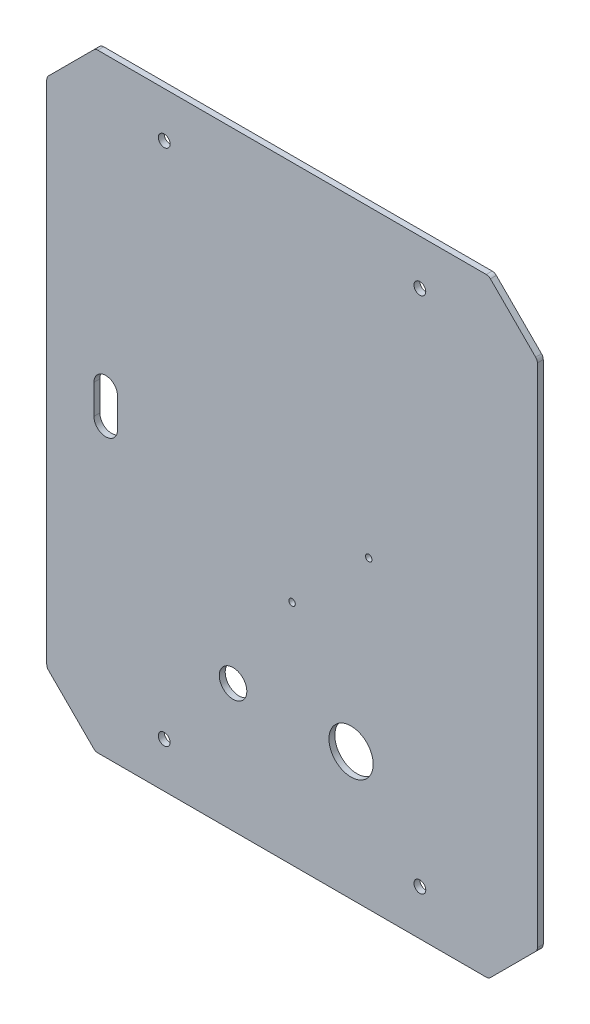
ISO-10303-21;
HEADER;
FILE_DESCRIPTION(('STEP AP214'),'2;1');
FILE_NAME('part.step','',(''),(''),'','','');
FILE_SCHEMA(('AUTOMOTIVE_DESIGN { 1 0 10303 214 1 1 1 1 }'));
ENDSEC;
DATA;
#1=APPLICATION_CONTEXT('core data for automotive mechanical design processes');
#2=APPLICATION_PROTOCOL_DEFINITION('international standard','automotive_design',2000,#1);
#3=PRODUCT_CONTEXT('',#1,'mechanical');
#4=PRODUCT('Part','Part','',(#3));
#5=PRODUCT_RELATED_PRODUCT_CATEGORY('part','',(#4));
#6=PRODUCT_DEFINITION_FORMATION('','',#4);
#7=PRODUCT_DEFINITION_CONTEXT('part definition',#1,'design');
#8=PRODUCT_DEFINITION('design','',#6,#7);
#9=PRODUCT_DEFINITION_SHAPE('','',#8);
#10=(LENGTH_UNIT() NAMED_UNIT(*) SI_UNIT(.MILLI.,.METRE.));
#11=(NAMED_UNIT(*) PLANE_ANGLE_UNIT() SI_UNIT($,.RADIAN.));
#12=(NAMED_UNIT(*) SI_UNIT($,.STERADIAN.) SOLID_ANGLE_UNIT());
#13=UNCERTAINTY_MEASURE_WITH_UNIT(LENGTH_MEASURE(1.E-05),#10,'distance_accuracy_value','');
#14=(GEOMETRIC_REPRESENTATION_CONTEXT(3) GLOBAL_UNCERTAINTY_ASSIGNED_CONTEXT((#13)) GLOBAL_UNIT_ASSIGNED_CONTEXT((#10,
#11,#12)) REPRESENTATION_CONTEXT('',''));
#15=CARTESIAN_POINT('',(0.,0.,0.));
#16=DIRECTION('',(0.,0.,1.));
#17=DIRECTION('',(1.,0.,0.));
#18=AXIS2_PLACEMENT_3D('',#15,#16,#17);
#19=CARTESIAN_POINT('',(24.7487373415291,24.7487373415292,3.));
#20=DIRECTION('',(-0.707106781186548,0.707106781186547,0.));
#21=DIRECTION('',(-0.707106781186547,-0.707106781186548,0.));
#22=AXIS2_PLACEMENT_3D('',#19,#20,#21);
#23=PLANE('',#22);
#24=DIRECTION('',(0.707106781186547,0.707106781186548,0.));
#25=VECTOR('',#24,1.);
#26=CARTESIAN_POINT('',(24.7487373415291,24.7487373415292,0.));
#27=LINE('',#26,#25);
#28=CARTESIAN_POINT('',(0.87867965644035,0.87867965644035,0.));
#29=VERTEX_POINT('',#28);
#30=CARTESIAN_POINT('',(23.8700576850888,23.8700576850888,0.));
#31=VERTEX_POINT('',#30);
#32=EDGE_CURVE('E272',#29,#31,#27,.T.);
#33=ORIENTED_EDGE('',*,*,#32,.T.);
#34=DIRECTION('',(0.,0.,-1.));
#35=VECTOR('',#34,1.);
#36=CARTESIAN_POINT('',(23.8700576850888,23.8700576850888,3.));
#37=LINE('',#36,#35);
#38=CARTESIAN_POINT('',(23.8700576850888,23.8700576850888,3.));
#39=VERTEX_POINT('',#38);
#40=EDGE_CURVE('E12',#31,#39,#37,.F.);
#41=ORIENTED_EDGE('',*,*,#40,.T.);
#42=DIRECTION('',(0.707106781186547,0.707106781186548,0.));
#43=VECTOR('',#42,1.);
#44=CARTESIAN_POINT('',(24.7487373415291,24.7487373415292,3.));
#45=LINE('',#44,#43);
#46=CARTESIAN_POINT('',(0.87867965644035,0.87867965644035,3.));
#47=VERTEX_POINT('',#46);
#48=EDGE_CURVE('E278',#47,#39,#45,.T.);
#49=ORIENTED_EDGE('',*,*,#48,.F.);
#50=DIRECTION('',(0.,0.,-1.));
#51=VECTOR('',#50,1.);
#52=CARTESIAN_POINT('',(0.87867965644035,0.878679656440354,3.));
#53=LINE('',#52,#51);
#54=EDGE_CURVE('E54',#47,#29,#53,.T.);
#55=ORIENTED_EDGE('',*,*,#54,.T.);
#56=EDGE_LOOP('',(#33,#41,#49,#55));
#57=FACE_BOUND('',#56,.T.);
#58=ADVANCED_FACE('F46',(#57),#23,.F.);
#59=CARTESIAN_POINT('',(24.7487373415291,284.748737341529,3.));
#60=DIRECTION('',(-1.,0.,0.));
#61=DIRECTION('',(0.,-1.,0.));
#62=AXIS2_PLACEMENT_3D('',#59,#60,#61);
#63=PLANE('',#62);
#64=DIRECTION('',(0.,1.,0.));
#65=VECTOR('',#64,1.);
#66=CARTESIAN_POINT('',(24.7487373415291,284.748737341529,0.));
#67=LINE('',#66,#65);
#68=CARTESIAN_POINT('',(24.7487373415291,25.9913780286485,0.));
#69=VERTEX_POINT('',#68);
#70=CARTESIAN_POINT('',(24.7487373415291,283.50609665441,0.));
#71=VERTEX_POINT('',#70);
#72=EDGE_CURVE('E316',#69,#71,#67,.T.);
#73=ORIENTED_EDGE('',*,*,#72,.T.);
#74=DIRECTION('',(0.,0.,-1.));
#75=VECTOR('',#74,1.);
#76=CARTESIAN_POINT('',(24.7487373415291,283.50609665441,3.));
#77=LINE('',#76,#75);
#78=CARTESIAN_POINT('',(24.7487373415291,283.50609665441,3.));
#79=VERTEX_POINT('',#78);
#80=EDGE_CURVE('E400',#71,#79,#77,.F.);
#81=ORIENTED_EDGE('',*,*,#80,.T.);
#82=DIRECTION('',(0.,1.,0.));
#83=VECTOR('',#82,1.);
#84=CARTESIAN_POINT('',(24.7487373415291,284.748737341529,3.));
#85=LINE('',#84,#83);
#86=CARTESIAN_POINT('',(24.7487373415291,25.9913780286485,3.));
#87=VERTEX_POINT('',#86);
#88=EDGE_CURVE('E423',#87,#79,#85,.T.);
#89=ORIENTED_EDGE('',*,*,#88,.F.);
#90=DIRECTION('',(0.,0.,-1.));
#91=VECTOR('',#90,1.);
#92=CARTESIAN_POINT('',(24.7487373415291,25.9913780286485,3.));
#93=LINE('',#92,#91);
#94=EDGE_CURVE('E397',#87,#69,#93,.T.);
#95=ORIENTED_EDGE('',*,*,#94,.T.);
#96=EDGE_LOOP('',(#73,#81,#89,#95));
#97=FACE_BOUND('',#96,.T.);
#98=ADVANCED_FACE('F420',(#97),#63,.F.);
#99=CARTESIAN_POINT('',(0.,309.497474683058,3.));
#100=DIRECTION('',(-0.707106781186547,-0.707106781186548,0.));
#101=DIRECTION('',(0.707106781186548,-0.707106781186547,0.));
#102=AXIS2_PLACEMENT_3D('',#99,#100,#101);
#103=PLANE('',#102);
#104=DIRECTION('',(-0.707106781186548,0.707106781186547,0.));
#105=VECTOR('',#104,1.);
#106=CARTESIAN_POINT('',(0.,309.497474683058,0.));
#107=LINE('',#106,#105);
#108=CARTESIAN_POINT('',(23.8700576850888,285.62741699797,0.));
#109=VERTEX_POINT('',#108);
#110=CARTESIAN_POINT('',(0.878679656440274,308.618795026618,0.));
#111=VERTEX_POINT('',#110);
#112=EDGE_CURVE('E321',#109,#111,#107,.T.);
#113=ORIENTED_EDGE('',*,*,#112,.T.);
#114=DIRECTION('',(0.,0.,-1.));
#115=VECTOR('',#114,1.);
#116=CARTESIAN_POINT('',(0.878679656440274,308.618795026618,3.));
#117=LINE('',#116,#115);
#118=CARTESIAN_POINT('',(0.878679656440274,308.618795026618,3.));
#119=VERTEX_POINT('',#118);
#120=EDGE_CURVE('E395',#111,#119,#117,.F.);
#121=ORIENTED_EDGE('',*,*,#120,.T.);
#122=DIRECTION('',(-0.707106781186548,0.707106781186547,0.));
#123=VECTOR('',#122,1.);
#124=CARTESIAN_POINT('',(0.,309.497474683058,3.));
#125=LINE('',#124,#123);
#126=CARTESIAN_POINT('',(23.8700576850888,285.62741699797,3.));
#127=VERTEX_POINT('',#126);
#128=EDGE_CURVE('E426',#127,#119,#125,.T.);
#129=ORIENTED_EDGE('',*,*,#128,.F.);
#130=DIRECTION('',(0.,0.,-1.));
#131=VECTOR('',#130,1.);
#132=CARTESIAN_POINT('',(23.8700576850888,285.62741699797,3.));
#133=LINE('',#132,#131);
#134=EDGE_CURVE('E392',#127,#109,#133,.T.);
#135=ORIENTED_EDGE('',*,*,#134,.T.);
#136=EDGE_LOOP('',(#113,#121,#129,#135));
#137=FACE_BOUND('',#136,.T.);
#138=ADVANCED_FACE('F474',(#137),#103,.F.);
#139=CARTESIAN_POINT('',(-200.,309.497474683058,3.));
#140=DIRECTION('',(0.,-1.,0.));
#141=DIRECTION('',(0.,0.,-1.));
#142=AXIS2_PLACEMENT_3D('',#139,#140,#141);
#143=PLANE('',#142);
#144=DIRECTION('',(-1.,0.,0.));
#145=VECTOR('',#144,1.);
#146=CARTESIAN_POINT('',(-200.,309.497474683058,0.));
#147=LINE('',#146,#145);
#148=CARTESIAN_POINT('',(-1.24264068711938,309.497474683058,0.));
#149=VERTEX_POINT('',#148);
#150=CARTESIAN_POINT('',(-198.757359312881,309.497474683058,0.));
#151=VERTEX_POINT('',#150);
#152=EDGE_CURVE('E325',#149,#151,#147,.T.);
#153=ORIENTED_EDGE('',*,*,#152,.T.);
#154=DIRECTION('',(0.,0.,-1.));
#155=VECTOR('',#154,1.);
#156=CARTESIAN_POINT('',(-198.757359312881,309.497474683058,3.));
#157=LINE('',#156,#155);
#158=CARTESIAN_POINT('',(-198.757359312881,309.497474683058,3.));
#159=VERTEX_POINT('',#158);
#160=EDGE_CURVE('E390',#151,#159,#157,.F.);
#161=ORIENTED_EDGE('',*,*,#160,.T.);
#162=DIRECTION('',(-1.,0.,0.));
#163=VECTOR('',#162,1.);
#164=CARTESIAN_POINT('',(-200.,309.497474683058,3.));
#165=LINE('',#164,#163);
#166=CARTESIAN_POINT('',(-1.24264068711938,309.497474683058,3.));
#167=VERTEX_POINT('',#166);
#168=EDGE_CURVE('E428',#167,#159,#165,.T.);
#169=ORIENTED_EDGE('',*,*,#168,.F.);
#170=DIRECTION('',(0.,0.,-1.));
#171=VECTOR('',#170,1.);
#172=CARTESIAN_POINT('',(-1.24264068711938,309.497474683058,3.));
#173=LINE('',#172,#171);
#174=EDGE_CURVE('E387',#167,#149,#173,.T.);
#175=ORIENTED_EDGE('',*,*,#174,.T.);
#176=EDGE_LOOP('',(#153,#161,#169,#175));
#177=FACE_BOUND('',#176,.T.);
#178=ADVANCED_FACE('F479',(#177),#143,.F.);
#179=CARTESIAN_POINT('',(-224.748737341529,284.748737341529,3.));
#180=DIRECTION('',(0.707106781186549,-0.707106781186546,0.));
#181=DIRECTION('',(0.707106781186546,0.707106781186549,0.));
#182=AXIS2_PLACEMENT_3D('',#179,#180,#181);
#183=PLANE('',#182);
#184=DIRECTION('',(-0.707106781186546,-0.707106781186549,0.));
#185=VECTOR('',#184,1.);
#186=CARTESIAN_POINT('',(-224.748737341529,284.748737341529,0.));
#187=LINE('',#186,#185);
#188=CARTESIAN_POINT('',(-200.87867965644,308.618795026618,0.));
#189=VERTEX_POINT('',#188);
#190=CARTESIAN_POINT('',(-223.870057685089,285.62741699797,0.));
#191=VERTEX_POINT('',#190);
#192=EDGE_CURVE('E344',#189,#191,#187,.T.);
#193=ORIENTED_EDGE('',*,*,#192,.T.);
#194=DIRECTION('',(0.,0.,-1.));
#195=VECTOR('',#194,1.);
#196=CARTESIAN_POINT('',(-223.870057685089,285.62741699797,3.));
#197=LINE('',#196,#195);
#198=CARTESIAN_POINT('',(-223.870057685089,285.62741699797,3.));
#199=VERTEX_POINT('',#198);
#200=EDGE_CURVE('E385',#191,#199,#197,.F.);
#201=ORIENTED_EDGE('',*,*,#200,.T.);
#202=DIRECTION('',(-0.707106781186546,-0.707106781186549,0.));
#203=VECTOR('',#202,1.);
#204=CARTESIAN_POINT('',(-224.748737341529,284.748737341529,3.));
#205=LINE('',#204,#203);
#206=CARTESIAN_POINT('',(-200.87867965644,308.618795026618,3.));
#207=VERTEX_POINT('',#206);
#208=EDGE_CURVE('E433',#207,#199,#205,.T.);
#209=ORIENTED_EDGE('',*,*,#208,.F.);
#210=DIRECTION('',(0.,0.,-1.));
#211=VECTOR('',#210,1.);
#212=CARTESIAN_POINT('',(-200.87867965644,308.618795026618,3.));
#213=LINE('',#212,#211);
#214=EDGE_CURVE('E382',#207,#189,#213,.T.);
#215=ORIENTED_EDGE('',*,*,#214,.T.);
#216=EDGE_LOOP('',(#193,#201,#209,#215));
#217=FACE_BOUND('',#216,.T.);
#218=ADVANCED_FACE('F483',(#217),#183,.F.);
#219=CARTESIAN_POINT('',(-224.748737341529,24.7487373415292,3.));
#220=DIRECTION('',(1.,0.,0.));
#221=DIRECTION('',(0.,1.,0.));
#222=AXIS2_PLACEMENT_3D('',#219,#220,#221);
#223=PLANE('',#222);
#224=DIRECTION('',(0.,-1.,0.));
#225=VECTOR('',#224,1.);
#226=CARTESIAN_POINT('',(-224.748737341529,24.7487373415292,0.));
#227=LINE('',#226,#225);
#228=CARTESIAN_POINT('',(-224.748737341529,283.50609665441,0.));
#229=VERTEX_POINT('',#228);
#230=CARTESIAN_POINT('',(-224.748737341529,25.9913780286484,0.));
#231=VERTEX_POINT('',#230);
#232=EDGE_CURVE('E347',#229,#231,#227,.T.);
#233=ORIENTED_EDGE('',*,*,#232,.T.);
#234=DIRECTION('',(0.,0.,-1.));
#235=VECTOR('',#234,1.);
#236=CARTESIAN_POINT('',(-224.748737341529,25.9913780286484,3.));
#237=LINE('',#236,#235);
#238=CARTESIAN_POINT('',(-224.748737341529,25.9913780286484,3.));
#239=VERTEX_POINT('',#238);
#240=EDGE_CURVE('E380',#231,#239,#237,.F.);
#241=ORIENTED_EDGE('',*,*,#240,.T.);
#242=DIRECTION('',(0.,-1.,0.));
#243=VECTOR('',#242,1.);
#244=CARTESIAN_POINT('',(-224.748737341529,24.7487373415292,3.));
#245=LINE('',#244,#243);
#246=CARTESIAN_POINT('',(-224.748737341529,283.50609665441,3.));
#247=VERTEX_POINT('',#246);
#248=EDGE_CURVE('E436',#247,#239,#245,.T.);
#249=ORIENTED_EDGE('',*,*,#248,.F.);
#250=DIRECTION('',(0.,0.,-1.));
#251=VECTOR('',#250,1.);
#252=CARTESIAN_POINT('',(-224.748737341529,283.50609665441,3.));
#253=LINE('',#252,#251);
#254=EDGE_CURVE('E377',#247,#229,#253,.T.);
#255=ORIENTED_EDGE('',*,*,#254,.T.);
#256=EDGE_LOOP('',(#233,#241,#249,#255));
#257=FACE_BOUND('',#256,.T.);
#258=ADVANCED_FACE('F487',(#257),#223,.F.);
#259=CARTESIAN_POINT('',(-200.,0.,3.));
#260=DIRECTION('',(0.707106781186547,0.707106781186548,0.));
#261=DIRECTION('',(-0.707106781186548,0.707106781186547,0.));
#262=AXIS2_PLACEMENT_3D('',#259,#260,#261);
#263=PLANE('',#262);
#264=DIRECTION('',(0.707106781186548,-0.707106781186547,0.));
#265=VECTOR('',#264,1.);
#266=CARTESIAN_POINT('',(-200.,0.,0.));
#267=LINE('',#266,#265);
#268=CARTESIAN_POINT('',(-223.870057685089,23.8700576850888,0.));
#269=VERTEX_POINT('',#268);
#270=CARTESIAN_POINT('',(-200.87867965644,0.878679656440342,0.));
#271=VERTEX_POINT('',#270);
#272=EDGE_CURVE('E291',#269,#271,#267,.T.);
#273=ORIENTED_EDGE('',*,*,#272,.T.);
#274=DIRECTION('',(0.,0.,-1.));
#275=VECTOR('',#274,1.);
#276=CARTESIAN_POINT('',(-200.87867965644,0.878679656440346,3.));
#277=LINE('',#276,#275);
#278=CARTESIAN_POINT('',(-200.87867965644,0.878679656440342,3.));
#279=VERTEX_POINT('',#278);
#280=EDGE_CURVE('E359',#271,#279,#277,.F.);
#281=ORIENTED_EDGE('',*,*,#280,.T.);
#282=DIRECTION('',(0.707106781186548,-0.707106781186547,0.));
#283=VECTOR('',#282,1.);
#284=CARTESIAN_POINT('',(-200.,0.,3.));
#285=LINE('',#284,#283);
#286=CARTESIAN_POINT('',(-223.870057685089,23.8700576850888,3.));
#287=VERTEX_POINT('',#286);
#288=EDGE_CURVE('E438',#287,#279,#285,.T.);
#289=ORIENTED_EDGE('',*,*,#288,.F.);
#290=DIRECTION('',(0.,0.,-1.));
#291=VECTOR('',#290,1.);
#292=CARTESIAN_POINT('',(-223.870057685089,23.8700576850888,3.));
#293=LINE('',#292,#291);
#294=EDGE_CURVE('E356',#287,#269,#293,.T.);
#295=ORIENTED_EDGE('',*,*,#294,.T.);
#296=EDGE_LOOP('',(#273,#281,#289,#295));
#297=FACE_BOUND('',#296,.T.);
#298=ADVANCED_FACE('F453',(#297),#263,.F.);
#299=CARTESIAN_POINT('',(0.,0.,3.));
#300=DIRECTION('',(0.,1.,0.));
#301=DIRECTION('',(0.,0.,1.));
#302=AXIS2_PLACEMENT_3D('',#299,#300,#301);
#303=PLANE('',#302);
#304=DIRECTION('',(1.,0.,0.));
#305=VECTOR('',#304,1.);
#306=CARTESIAN_POINT('',(0.,0.,3.));
#307=LINE('',#306,#305);
#308=CARTESIAN_POINT('',(-198.757359312881,0.,3.));
#309=VERTEX_POINT('',#308);
#310=CARTESIAN_POINT('',(-1.2426406871193,0.,3.));
#311=VERTEX_POINT('',#310);
#312=EDGE_CURVE('E297',#309,#311,#307,.T.);
#313=ORIENTED_EDGE('',*,*,#312,.F.);
#314=DIRECTION('',(0.,0.,-1.));
#315=VECTOR('',#314,1.);
#316=CARTESIAN_POINT('',(-198.757359312881,0.,3.));
#317=LINE('',#316,#315);
#318=CARTESIAN_POINT('',(-198.757359312881,0.,0.));
#319=VERTEX_POINT('',#318);
#320=EDGE_CURVE('E296',#309,#319,#317,.T.);
#321=ORIENTED_EDGE('',*,*,#320,.T.);
#322=DIRECTION('',(1.,0.,0.));
#323=VECTOR('',#322,1.);
#324=CARTESIAN_POINT('',(0.,0.,0.));
#325=LINE('',#324,#323);
#326=CARTESIAN_POINT('',(-1.2426406871193,0.,0.));
#327=VERTEX_POINT('',#326);
#328=EDGE_CURVE('E286',#319,#327,#325,.T.);
#329=ORIENTED_EDGE('',*,*,#328,.T.);
#330=DIRECTION('',(0.,0.,-1.));
#331=VECTOR('',#330,1.);
#332=CARTESIAN_POINT('',(-1.2426406871193,0.,3.));
#333=LINE('',#332,#331);
#334=EDGE_CURVE('E294',#327,#311,#333,.F.);
#335=ORIENTED_EDGE('',*,*,#334,.T.);
#336=EDGE_LOOP('',(#313,#321,#329,#335));
#337=FACE_BOUND('',#336,.T.);
#338=ADVANCED_FACE('F447',(#337),#303,.F.);
#339=CARTESIAN_POINT('',(0.,0.,3.));
#340=DIRECTION('',(0.,0.,-1.));
#341=DIRECTION('',(-1.,0.,0.));
#342=AXIS2_PLACEMENT_3D('',#339,#340,#341);
#343=PLANE('',#342);
#344=DIRECTION('',(0.,-1.,0.));
#345=VECTOR('',#344,1.);
#346=CARTESIAN_POINT('',(-188.748737341529,147.248737341529,3.));
#347=LINE('',#346,#345);
#348=CARTESIAN_POINT('',(-188.748737341529,162.248737341529,3.));
#349=VERTEX_POINT('',#348);
#350=CARTESIAN_POINT('',(-188.748737341529,147.248737341529,3.));
#351=VERTEX_POINT('',#350);
#352=EDGE_CURVE('E190',#349,#351,#347,.T.);
#353=ORIENTED_EDGE('',*,*,#352,.T.);
#354=CARTESIAN_POINT('',(-194.748737341529,147.248737341529,3.));
#355=DIRECTION('',(0.,0.,-1.));
#356=DIRECTION('',(-1.,0.,0.));
#357=AXIS2_PLACEMENT_3D('',#354,#355,#356);
#358=CIRCLE('',#357,6.00000000000001);
#359=CARTESIAN_POINT('',(-200.748737341529,147.248737341529,3.));
#360=VERTEX_POINT('',#359);
#361=EDGE_CURVE('E184',#351,#360,#358,.T.);
#362=ORIENTED_EDGE('',*,*,#361,.T.);
#363=DIRECTION('',(0.,1.,0.));
#364=VECTOR('',#363,1.);
#365=CARTESIAN_POINT('',(-200.748737341529,147.248737341529,3.));
#366=LINE('',#365,#364);
#367=CARTESIAN_POINT('',(-200.748737341529,162.248737341529,3.));
#368=VERTEX_POINT('',#367);
#369=EDGE_CURVE('E193',#360,#368,#366,.T.);
#370=ORIENTED_EDGE('',*,*,#369,.T.);
#371=CARTESIAN_POINT('',(-194.748737341529,162.248737341529,3.));
#372=DIRECTION('',(0.,0.,-1.));
#373=DIRECTION('',(-1.,0.,0.));
#374=AXIS2_PLACEMENT_3D('',#371,#372,#373);
#375=CIRCLE('',#374,6.00000000000001);
#376=EDGE_CURVE('E61',#368,#349,#375,.T.);
#377=ORIENTED_EDGE('',*,*,#376,.T.);
#378=EDGE_LOOP('',(#353,#362,#370,#377));
#379=FACE_BOUND('',#378,.T.);
#380=CARTESIAN_POINT('',(-130.,65.,3.));
#381=DIRECTION('',(0.,0.,-1.));
#382=DIRECTION('',(-1.,0.,0.));
#383=AXIS2_PLACEMENT_3D('',#380,#381,#382);
#384=CIRCLE('',#383,7.00000000000002);
#385=CARTESIAN_POINT('',(-137.,65.,3.));
#386=VERTEX_POINT('',#385);
#387=EDGE_CURVE('E226',#386,#386,#384,.T.);
#388=ORIENTED_EDGE('',*,*,#387,.T.);
#389=EDGE_LOOP('',(#388));
#390=FACE_BOUND('',#389,.T.);
#391=CARTESIAN_POINT('',(-70.0000000000001,65.,3.));
#392=DIRECTION('',(0.,0.,-1.));
#393=DIRECTION('',(-1.,0.,0.));
#394=AXIS2_PLACEMENT_3D('',#391,#392,#393);
#395=CIRCLE('',#394,11.25);
#396=CARTESIAN_POINT('',(-81.2500000000001,65.,3.));
#397=VERTEX_POINT('',#396);
#398=EDGE_CURVE('E233',#397,#397,#395,.T.);
#399=ORIENTED_EDGE('',*,*,#398,.T.);
#400=EDGE_LOOP('',(#399));
#401=FACE_BOUND('',#400,.T.);
#402=CARTESIAN_POINT('',(-61.,154.748737341529,3.));
#403=DIRECTION('',(0.,0.,-1.));
#404=DIRECTION('',(-1.,0.,0.));
#405=AXIS2_PLACEMENT_3D('',#402,#403,#404);
#406=CIRCLE('',#405,1.65000000000001);
#407=CARTESIAN_POINT('',(-62.65,154.748737341529,3.));
#408=VERTEX_POINT('',#407);
#409=EDGE_CURVE('E243',#408,#408,#406,.T.);
#410=ORIENTED_EDGE('',*,*,#409,.T.);
#411=EDGE_LOOP('',(#410));
#412=FACE_BOUND('',#411,.T.);
#413=CARTESIAN_POINT('',(-100.,115.748737341529,3.));
#414=DIRECTION('',(0.,0.,-1.));
#415=DIRECTION('',(-1.,0.,0.));
#416=AXIS2_PLACEMENT_3D('',#413,#414,#415);
#417=CIRCLE('',#416,1.65);
#418=CARTESIAN_POINT('',(-101.65,115.748737341529,3.));
#419=VERTEX_POINT('',#418);
#420=EDGE_CURVE('E254',#419,#419,#417,.T.);
#421=ORIENTED_EDGE('',*,*,#420,.T.);
#422=EDGE_LOOP('',(#421));
#423=FACE_BOUND('',#422,.T.);
#424=CARTESIAN_POINT('',(-35.,23.,3.));
#425=DIRECTION('',(0.,0.,-1.));
#426=DIRECTION('',(1.,0.,0.));
#427=AXIS2_PLACEMENT_3D('',#424,#425,#426);
#428=CIRCLE('',#427,3.);
#429=CARTESIAN_POINT('',(-32.,23.,3.));
#430=VERTEX_POINT('',#429);
#431=EDGE_CURVE('E245',#430,#430,#428,.T.);
#432=ORIENTED_EDGE('',*,*,#431,.T.);
#433=EDGE_LOOP('',(#432));
#434=FACE_BOUND('',#433,.T.);
#435=CARTESIAN_POINT('',(-165.,23.,3.));
#436=DIRECTION('',(0.,0.,-1.));
#437=DIRECTION('',(-1.,0.,0.));
#438=AXIS2_PLACEMENT_3D('',#435,#436,#437);
#439=CIRCLE('',#438,3.00000000000002);
#440=CARTESIAN_POINT('',(-168.,23.,3.));
#441=VERTEX_POINT('',#440);
#442=EDGE_CURVE('E266',#441,#441,#439,.T.);
#443=ORIENTED_EDGE('',*,*,#442,.T.);
#444=EDGE_LOOP('',(#443));
#445=FACE_BOUND('',#444,.T.);
#446=CARTESIAN_POINT('',(-165.,286.497474683058,3.));
#447=DIRECTION('',(0.,0.,-1.));
#448=DIRECTION('',(1.,0.,0.));
#449=AXIS2_PLACEMENT_3D('',#446,#447,#448);
#450=CIRCLE('',#449,3.00000000000002);
#451=CARTESIAN_POINT('',(-162.,286.497474683058,3.));
#452=VERTEX_POINT('',#451);
#453=EDGE_CURVE('E565',#452,#452,#450,.T.);
#454=ORIENTED_EDGE('',*,*,#453,.T.);
#455=EDGE_LOOP('',(#454));
#456=FACE_BOUND('',#455,.T.);
#457=CARTESIAN_POINT('',(-35.0000000000001,286.497474683058,3.));
#458=DIRECTION('',(0.,0.,-1.));
#459=DIRECTION('',(-1.,0.,0.));
#460=AXIS2_PLACEMENT_3D('',#457,#458,#459);
#461=CIRCLE('',#460,3.);
#462=CARTESIAN_POINT('',(-38.0000000000001,286.497474683058,3.));
#463=VERTEX_POINT('',#462);
#464=EDGE_CURVE('E269',#463,#463,#461,.T.);
#465=ORIENTED_EDGE('',*,*,#464,.T.);
#466=EDGE_LOOP('',(#465));
#467=FACE_BOUND('',#466,.T.);
#468=ORIENTED_EDGE('',*,*,#288,.T.);
#469=CARTESIAN_POINT('',(-198.757359312881,3.,3.));
#470=DIRECTION('',(0.,0.,-1.));
#471=DIRECTION('',(-1.,0.,0.));
#472=AXIS2_PLACEMENT_3D('',#469,#470,#471);
#473=CIRCLE('',#472,3.);
#474=EDGE_CURVE('E375',#279,#309,#473,.F.);
#475=ORIENTED_EDGE('',*,*,#474,.T.);
#476=ORIENTED_EDGE('',*,*,#312,.T.);
#477=CARTESIAN_POINT('',(-1.2426406871193,3.,3.));
#478=DIRECTION('',(0.,0.,-1.));
#479=DIRECTION('',(-1.,0.,0.));
#480=AXIS2_PLACEMENT_3D('',#477,#478,#479);
#481=CIRCLE('',#480,3.);
#482=EDGE_CURVE('E361',#311,#47,#481,.F.);
#483=ORIENTED_EDGE('',*,*,#482,.T.);
#484=ORIENTED_EDGE('',*,*,#48,.T.);
#485=CARTESIAN_POINT('',(21.7487373415291,25.9913780286485,3.));
#486=DIRECTION('',(0.,0.,-1.));
#487=DIRECTION('',(-1.,0.,0.));
#488=AXIS2_PLACEMENT_3D('',#485,#486,#487);
#489=CIRCLE('',#488,3.);
#490=EDGE_CURVE('E363',#39,#87,#489,.F.);
#491=ORIENTED_EDGE('',*,*,#490,.T.);
#492=ORIENTED_EDGE('',*,*,#88,.T.);
#493=CARTESIAN_POINT('',(21.7487373415291,283.50609665441,3.));
#494=DIRECTION('',(0.,0.,-1.));
#495=DIRECTION('',(-1.,0.,0.));
#496=AXIS2_PLACEMENT_3D('',#493,#494,#495);
#497=CIRCLE('',#496,3.);
#498=EDGE_CURVE('E365',#79,#127,#497,.F.);
#499=ORIENTED_EDGE('',*,*,#498,.T.);
#500=ORIENTED_EDGE('',*,*,#128,.T.);
#501=CARTESIAN_POINT('',(-1.24264068711938,306.497474683058,3.));
#502=DIRECTION('',(0.,0.,-1.));
#503=DIRECTION('',(-1.,0.,0.));
#504=AXIS2_PLACEMENT_3D('',#501,#502,#503);
#505=CIRCLE('',#504,3.);
#506=EDGE_CURVE('E367',#119,#167,#505,.F.);
#507=ORIENTED_EDGE('',*,*,#506,.T.);
#508=ORIENTED_EDGE('',*,*,#168,.T.);
#509=CARTESIAN_POINT('',(-198.757359312881,306.497474683058,3.));
#510=DIRECTION('',(0.,0.,-1.));
#511=DIRECTION('',(-1.,0.,0.));
#512=AXIS2_PLACEMENT_3D('',#509,#510,#511);
#513=CIRCLE('',#512,3.);
#514=EDGE_CURVE('E369',#159,#207,#513,.F.);
#515=ORIENTED_EDGE('',*,*,#514,.T.);
#516=ORIENTED_EDGE('',*,*,#208,.T.);
#517=CARTESIAN_POINT('',(-221.748737341529,283.50609665441,3.));
#518=DIRECTION('',(0.,0.,-1.));
#519=DIRECTION('',(-1.,0.,0.));
#520=AXIS2_PLACEMENT_3D('',#517,#518,#519);
#521=CIRCLE('',#520,3.);
#522=EDGE_CURVE('E371',#199,#247,#521,.F.);
#523=ORIENTED_EDGE('',*,*,#522,.T.);
#524=ORIENTED_EDGE('',*,*,#248,.T.);
#525=CARTESIAN_POINT('',(-221.748737341529,25.9913780286484,3.));
#526=DIRECTION('',(0.,0.,-1.));
#527=DIRECTION('',(-1.,0.,0.));
#528=AXIS2_PLACEMENT_3D('',#525,#526,#527);
#529=CIRCLE('',#528,3.);
#530=EDGE_CURVE('E373',#239,#287,#529,.F.);
#531=ORIENTED_EDGE('',*,*,#530,.T.);
#532=EDGE_LOOP('',(#468,#475,#476,#483,#484,#491,#492,#499,#500,#507,#508,#515,#516,#523,#524,#531));
#533=FACE_BOUND('',#532,.T.);
#534=ADVANCED_FACE('F197',(#379,#390,#401,#412,#423,#434,#445,#456,#467,#533),#343,.F.);
#535=CARTESIAN_POINT('',(0.,0.,0.));
#536=DIRECTION('',(0.,0.,-1.));
#537=DIRECTION('',(-1.,0.,0.));
#538=AXIS2_PLACEMENT_3D('',#535,#536,#537);
#539=PLANE('',#538);
#540=CARTESIAN_POINT('',(-194.748737341529,147.248737341529,0.));
#541=DIRECTION('',(0.,0.,-1.));
#542=DIRECTION('',(-1.,0.,0.));
#543=AXIS2_PLACEMENT_3D('',#540,#541,#542);
#544=CIRCLE('',#543,6.00000000000001);
#545=CARTESIAN_POINT('',(-188.748737341529,147.248737341529,0.));
#546=VERTEX_POINT('',#545);
#547=CARTESIAN_POINT('',(-200.748737341529,147.248737341529,0.));
#548=VERTEX_POINT('',#547);
#549=EDGE_CURVE('E69',#546,#548,#544,.T.);
#550=ORIENTED_EDGE('',*,*,#549,.F.);
#551=DIRECTION('',(0.,-1.,0.));
#552=VECTOR('',#551,1.);
#553=CARTESIAN_POINT('',(-188.748737341529,147.248737341529,0.));
#554=LINE('',#553,#552);
#555=CARTESIAN_POINT('',(-188.748737341529,162.248737341529,0.));
#556=VERTEX_POINT('',#555);
#557=EDGE_CURVE('E200',#556,#546,#554,.T.);
#558=ORIENTED_EDGE('',*,*,#557,.F.);
#559=CARTESIAN_POINT('',(-194.748737341529,162.248737341529,0.));
#560=DIRECTION('',(0.,0.,-1.));
#561=DIRECTION('',(-1.,0.,0.));
#562=AXIS2_PLACEMENT_3D('',#559,#560,#561);
#563=CIRCLE('',#562,6.00000000000001);
#564=CARTESIAN_POINT('',(-200.748737341529,162.248737341529,0.));
#565=VERTEX_POINT('',#564);
#566=EDGE_CURVE('E203',#565,#556,#563,.T.);
#567=ORIENTED_EDGE('',*,*,#566,.F.);
#568=DIRECTION('',(0.,1.,0.));
#569=VECTOR('',#568,1.);
#570=CARTESIAN_POINT('',(-200.748737341529,147.248737341529,0.));
#571=LINE('',#570,#569);
#572=EDGE_CURVE('E210',#548,#565,#571,.T.);
#573=ORIENTED_EDGE('',*,*,#572,.F.);
#574=EDGE_LOOP('',(#550,#558,#567,#573));
#575=FACE_BOUND('',#574,.T.);
#576=CARTESIAN_POINT('',(-130.,65.,0.));
#577=DIRECTION('',(0.,0.,-1.));
#578=DIRECTION('',(-1.,0.,0.));
#579=AXIS2_PLACEMENT_3D('',#576,#577,#578);
#580=CIRCLE('',#579,7.00000000000002);
#581=CARTESIAN_POINT('',(-137.,65.,0.));
#582=VERTEX_POINT('',#581);
#583=EDGE_CURVE('E222',#582,#582,#580,.T.);
#584=ORIENTED_EDGE('',*,*,#583,.F.);
#585=EDGE_LOOP('',(#584));
#586=FACE_BOUND('',#585,.T.);
#587=CARTESIAN_POINT('',(-70.0000000000001,65.,0.));
#588=DIRECTION('',(0.,0.,-1.));
#589=DIRECTION('',(-1.,0.,0.));
#590=AXIS2_PLACEMENT_3D('',#587,#588,#589);
#591=CIRCLE('',#590,11.25);
#592=CARTESIAN_POINT('',(-81.2500000000001,65.,0.));
#593=VERTEX_POINT('',#592);
#594=EDGE_CURVE('E229',#593,#593,#591,.T.);
#595=ORIENTED_EDGE('',*,*,#594,.F.);
#596=EDGE_LOOP('',(#595));
#597=FACE_BOUND('',#596,.T.);
#598=CARTESIAN_POINT('',(-61.,154.748737341529,0.));
#599=DIRECTION('',(0.,0.,-1.));
#600=DIRECTION('',(-1.,0.,0.));
#601=AXIS2_PLACEMENT_3D('',#598,#599,#600);
#602=CIRCLE('',#601,1.65000000000001);
#603=CARTESIAN_POINT('',(-62.65,154.748737341529,0.));
#604=VERTEX_POINT('',#603);
#605=EDGE_CURVE('E246',#604,#604,#602,.T.);
#606=ORIENTED_EDGE('',*,*,#605,.F.);
#607=EDGE_LOOP('',(#606));
#608=FACE_BOUND('',#607,.T.);
#609=CARTESIAN_POINT('',(-100.,115.748737341529,0.));
#610=DIRECTION('',(0.,0.,-1.));
#611=DIRECTION('',(-1.,0.,0.));
#612=AXIS2_PLACEMENT_3D('',#609,#610,#611);
#613=CIRCLE('',#612,1.65);
#614=CARTESIAN_POINT('',(-101.65,115.748737341529,0.));
#615=VERTEX_POINT('',#614);
#616=EDGE_CURVE('E250',#615,#615,#613,.T.);
#617=ORIENTED_EDGE('',*,*,#616,.F.);
#618=EDGE_LOOP('',(#617));
#619=FACE_BOUND('',#618,.T.);
#620=CARTESIAN_POINT('',(-35.,23.,0.));
#621=DIRECTION('',(0.,0.,-1.));
#622=DIRECTION('',(1.,0.,0.));
#623=AXIS2_PLACEMENT_3D('',#620,#621,#622);
#624=CIRCLE('',#623,3.);
#625=CARTESIAN_POINT('',(-32.,23.,0.));
#626=VERTEX_POINT('',#625);
#627=EDGE_CURVE('E261',#626,#626,#624,.T.);
#628=ORIENTED_EDGE('',*,*,#627,.F.);
#629=EDGE_LOOP('',(#628));
#630=FACE_BOUND('',#629,.T.);
#631=CARTESIAN_POINT('',(-165.,23.,0.));
#632=DIRECTION('',(0.,0.,-1.));
#633=DIRECTION('',(-1.,0.,0.));
#634=AXIS2_PLACEMENT_3D('',#631,#632,#633);
#635=CIRCLE('',#634,3.00000000000002);
#636=CARTESIAN_POINT('',(-168.,23.,0.));
#637=VERTEX_POINT('',#636);
#638=EDGE_CURVE('E558',#637,#637,#635,.T.);
#639=ORIENTED_EDGE('',*,*,#638,.F.);
#640=EDGE_LOOP('',(#639));
#641=FACE_BOUND('',#640,.T.);
#642=CARTESIAN_POINT('',(-165.,286.497474683058,0.));
#643=DIRECTION('',(0.,0.,-1.));
#644=DIRECTION('',(1.,0.,0.));
#645=AXIS2_PLACEMENT_3D('',#642,#643,#644);
#646=CIRCLE('',#645,3.00000000000002);
#647=CARTESIAN_POINT('',(-162.,286.497474683058,0.));
#648=VERTEX_POINT('',#647);
#649=EDGE_CURVE('E277',#648,#648,#646,.T.);
#650=ORIENTED_EDGE('',*,*,#649,.F.);
#651=EDGE_LOOP('',(#650));
#652=FACE_BOUND('',#651,.T.);
#653=CARTESIAN_POINT('',(-35.0000000000001,286.497474683058,0.));
#654=DIRECTION('',(0.,0.,-1.));
#655=DIRECTION('',(-1.,0.,0.));
#656=AXIS2_PLACEMENT_3D('',#653,#654,#655);
#657=CIRCLE('',#656,3.);
#658=CARTESIAN_POINT('',(-38.0000000000001,286.497474683058,0.));
#659=VERTEX_POINT('',#658);
#660=EDGE_CURVE('E273',#659,#659,#657,.T.);
#661=ORIENTED_EDGE('',*,*,#660,.F.);
#662=EDGE_LOOP('',(#661));
#663=FACE_BOUND('',#662,.T.);
#664=ORIENTED_EDGE('',*,*,#328,.F.);
#665=CARTESIAN_POINT('',(-198.757359312881,3.,0.));
#666=DIRECTION('',(0.,0.,-1.));
#667=DIRECTION('',(-1.,0.,0.));
#668=AXIS2_PLACEMENT_3D('',#665,#666,#667);
#669=CIRCLE('',#668,3.);
#670=EDGE_CURVE('E353',#319,#271,#669,.T.);
#671=ORIENTED_EDGE('',*,*,#670,.T.);
#672=ORIENTED_EDGE('',*,*,#272,.F.);
#673=CARTESIAN_POINT('',(-221.748737341529,25.9913780286484,0.));
#674=DIRECTION('',(0.,0.,-1.));
#675=DIRECTION('',(-1.,0.,0.));
#676=AXIS2_PLACEMENT_3D('',#673,#674,#675);
#677=CIRCLE('',#676,3.);
#678=EDGE_CURVE('E351',#269,#231,#677,.T.);
#679=ORIENTED_EDGE('',*,*,#678,.T.);
#680=ORIENTED_EDGE('',*,*,#232,.F.);
#681=CARTESIAN_POINT('',(-221.748737341529,283.50609665441,0.));
#682=DIRECTION('',(0.,0.,-1.));
#683=DIRECTION('',(-1.,0.,0.));
#684=AXIS2_PLACEMENT_3D('',#681,#682,#683);
#685=CIRCLE('',#684,3.);
#686=EDGE_CURVE('E338',#229,#191,#685,.T.);
#687=ORIENTED_EDGE('',*,*,#686,.T.);
#688=ORIENTED_EDGE('',*,*,#192,.F.);
#689=CARTESIAN_POINT('',(-198.757359312881,306.497474683058,0.));
#690=DIRECTION('',(0.,0.,-1.));
#691=DIRECTION('',(-1.,0.,0.));
#692=AXIS2_PLACEMENT_3D('',#689,#690,#691);
#693=CIRCLE('',#692,3.);
#694=EDGE_CURVE('E335',#189,#151,#693,.T.);
#695=ORIENTED_EDGE('',*,*,#694,.T.);
#696=ORIENTED_EDGE('',*,*,#152,.F.);
#697=CARTESIAN_POINT('',(-1.24264068711938,306.497474683058,0.));
#698=DIRECTION('',(0.,0.,-1.));
#699=DIRECTION('',(-1.,0.,0.));
#700=AXIS2_PLACEMENT_3D('',#697,#698,#699);
#701=CIRCLE('',#700,3.);
#702=EDGE_CURVE('E332',#149,#111,#701,.T.);
#703=ORIENTED_EDGE('',*,*,#702,.T.);
#704=ORIENTED_EDGE('',*,*,#112,.F.);
#705=CARTESIAN_POINT('',(21.7487373415291,283.50609665441,0.));
#706=DIRECTION('',(0.,0.,-1.));
#707=DIRECTION('',(-1.,0.,0.));
#708=AXIS2_PLACEMENT_3D('',#705,#706,#707);
#709=CIRCLE('',#708,3.);
#710=EDGE_CURVE('E305',#109,#71,#709,.T.);
#711=ORIENTED_EDGE('',*,*,#710,.T.);
#712=ORIENTED_EDGE('',*,*,#72,.F.);
#713=CARTESIAN_POINT('',(21.7487373415291,25.9913780286485,0.));
#714=DIRECTION('',(0.,0.,-1.));
#715=DIRECTION('',(-1.,0.,0.));
#716=AXIS2_PLACEMENT_3D('',#713,#714,#715);
#717=CIRCLE('',#716,3.);
#718=EDGE_CURVE('E302',#69,#31,#717,.T.);
#719=ORIENTED_EDGE('',*,*,#718,.T.);
#720=ORIENTED_EDGE('',*,*,#32,.F.);
#721=CARTESIAN_POINT('',(-1.2426406871193,3.,0.));
#722=DIRECTION('',(0.,0.,-1.));
#723=DIRECTION('',(-1.,0.,0.));
#724=AXIS2_PLACEMENT_3D('',#721,#722,#723);
#725=CIRCLE('',#724,3.);
#726=EDGE_CURVE('E299',#29,#327,#725,.T.);
#727=ORIENTED_EDGE('',*,*,#726,.T.);
#728=EDGE_LOOP('',(#664,#671,#672,#679,#680,#687,#688,#695,#696,#703,#704,#711,#712,#719,#720,#727));
#729=FACE_BOUND('',#728,.T.);
#730=ADVANCED_FACE('F412',(#575,#586,#597,#608,#619,#630,#641,#652,#663,#729),#539,.T.);
#731=CARTESIAN_POINT('',(-198.757359312881,3.,3.));
#732=DIRECTION('',(0.,0.,-1.));
#733=DIRECTION('',(-1.,0.,0.));
#734=AXIS2_PLACEMENT_3D('',#731,#732,#733);
#735=CYLINDRICAL_SURFACE('',#734,3.);
#736=ORIENTED_EDGE('',*,*,#474,.F.);
#737=ORIENTED_EDGE('',*,*,#280,.F.);
#738=ORIENTED_EDGE('',*,*,#670,.F.);
#739=ORIENTED_EDGE('',*,*,#320,.F.);
#740=EDGE_LOOP('',(#736,#737,#738,#739));
#741=FACE_BOUND('',#740,.T.);
#742=ADVANCED_FACE('F455',(#741),#735,.T.);
#743=CARTESIAN_POINT('',(-221.748737341529,25.9913780286484,3.));
#744=DIRECTION('',(0.,0.,-1.));
#745=DIRECTION('',(-1.,0.,0.));
#746=AXIS2_PLACEMENT_3D('',#743,#744,#745);
#747=CYLINDRICAL_SURFACE('',#746,3.);
#748=ORIENTED_EDGE('',*,*,#530,.F.);
#749=ORIENTED_EDGE('',*,*,#240,.F.);
#750=ORIENTED_EDGE('',*,*,#678,.F.);
#751=ORIENTED_EDGE('',*,*,#294,.F.);
#752=EDGE_LOOP('',(#748,#749,#750,#751));
#753=FACE_BOUND('',#752,.T.);
#754=ADVANCED_FACE('F457',(#753),#747,.T.);
#755=CARTESIAN_POINT('',(-221.748737341529,283.50609665441,3.));
#756=DIRECTION('',(0.,0.,-1.));
#757=DIRECTION('',(-1.,0.,0.));
#758=AXIS2_PLACEMENT_3D('',#755,#756,#757);
#759=CYLINDRICAL_SURFACE('',#758,3.);
#760=ORIENTED_EDGE('',*,*,#522,.F.);
#761=ORIENTED_EDGE('',*,*,#200,.F.);
#762=ORIENTED_EDGE('',*,*,#686,.F.);
#763=ORIENTED_EDGE('',*,*,#254,.F.);
#764=EDGE_LOOP('',(#760,#761,#762,#763));
#765=FACE_BOUND('',#764,.T.);
#766=ADVANCED_FACE('F463',(#765),#759,.T.);
#767=CARTESIAN_POINT('',(-198.757359312881,306.497474683058,3.));
#768=DIRECTION('',(0.,0.,-1.));
#769=DIRECTION('',(-1.,0.,0.));
#770=AXIS2_PLACEMENT_3D('',#767,#768,#769);
#771=CYLINDRICAL_SURFACE('',#770,3.);
#772=ORIENTED_EDGE('',*,*,#514,.F.);
#773=ORIENTED_EDGE('',*,*,#160,.F.);
#774=ORIENTED_EDGE('',*,*,#694,.F.);
#775=ORIENTED_EDGE('',*,*,#214,.F.);
#776=EDGE_LOOP('',(#772,#773,#774,#775));
#777=FACE_BOUND('',#776,.T.);
#778=ADVANCED_FACE('F672',(#777),#771,.T.);
#779=CARTESIAN_POINT('',(-1.24264068711938,306.497474683058,3.));
#780=DIRECTION('',(0.,0.,-1.));
#781=DIRECTION('',(-1.,0.,0.));
#782=AXIS2_PLACEMENT_3D('',#779,#780,#781);
#783=CYLINDRICAL_SURFACE('',#782,3.);
#784=ORIENTED_EDGE('',*,*,#506,.F.);
#785=ORIENTED_EDGE('',*,*,#120,.F.);
#786=ORIENTED_EDGE('',*,*,#702,.F.);
#787=ORIENTED_EDGE('',*,*,#174,.F.);
#788=EDGE_LOOP('',(#784,#785,#786,#787));
#789=FACE_BOUND('',#788,.T.);
#790=ADVANCED_FACE('F663',(#789),#783,.T.);
#791=CARTESIAN_POINT('',(21.7487373415291,283.50609665441,3.));
#792=DIRECTION('',(0.,0.,-1.));
#793=DIRECTION('',(-1.,0.,0.));
#794=AXIS2_PLACEMENT_3D('',#791,#792,#793);
#795=CYLINDRICAL_SURFACE('',#794,3.);
#796=ORIENTED_EDGE('',*,*,#498,.F.);
#797=ORIENTED_EDGE('',*,*,#80,.F.);
#798=ORIENTED_EDGE('',*,*,#710,.F.);
#799=ORIENTED_EDGE('',*,*,#134,.F.);
#800=EDGE_LOOP('',(#796,#797,#798,#799));
#801=FACE_BOUND('',#800,.T.);
#802=ADVANCED_FACE('F656',(#801),#795,.T.);
#803=CARTESIAN_POINT('',(21.7487373415291,25.9913780286485,3.));
#804=DIRECTION('',(0.,0.,-1.));
#805=DIRECTION('',(-1.,0.,0.));
#806=AXIS2_PLACEMENT_3D('',#803,#804,#805);
#807=CYLINDRICAL_SURFACE('',#806,3.);
#808=ORIENTED_EDGE('',*,*,#490,.F.);
#809=ORIENTED_EDGE('',*,*,#40,.F.);
#810=ORIENTED_EDGE('',*,*,#718,.F.);
#811=ORIENTED_EDGE('',*,*,#94,.F.);
#812=EDGE_LOOP('',(#808,#809,#810,#811));
#813=FACE_BOUND('',#812,.T.);
#814=ADVANCED_FACE('F417',(#813),#807,.T.);
#815=CARTESIAN_POINT('',(-1.2426406871193,3.,3.));
#816=DIRECTION('',(0.,0.,-1.));
#817=DIRECTION('',(-1.,0.,0.));
#818=AXIS2_PLACEMENT_3D('',#815,#816,#817);
#819=CYLINDRICAL_SURFACE('',#818,3.);
#820=ORIENTED_EDGE('',*,*,#482,.F.);
#821=ORIENTED_EDGE('',*,*,#334,.F.);
#822=ORIENTED_EDGE('',*,*,#726,.F.);
#823=ORIENTED_EDGE('',*,*,#54,.F.);
#824=EDGE_LOOP('',(#820,#821,#822,#823));
#825=FACE_BOUND('',#824,.T.);
#826=ADVANCED_FACE('F48',(#825),#819,.T.);
#827=CARTESIAN_POINT('',(-35.0000000000001,286.497474683058,3.));
#828=DIRECTION('',(0.,0.,-1.));
#829=DIRECTION('',(-1.,0.,0.));
#830=AXIS2_PLACEMENT_3D('',#827,#828,#829);
#831=CYLINDRICAL_SURFACE('',#830,3.);
#832=ORIENTED_EDGE('',*,*,#464,.F.);
#833=EDGE_LOOP('',(#832));
#834=FACE_BOUND('',#833,.T.);
#835=ORIENTED_EDGE('',*,*,#660,.T.);
#836=EDGE_LOOP('',(#835));
#837=FACE_BOUND('',#836,.T.);
#838=ADVANCED_FACE('F497',(#834,#837),#831,.F.);
#839=CARTESIAN_POINT('',(-165.,286.497474683058,3.));
#840=DIRECTION('',(0.,0.,-1.));
#841=DIRECTION('',(-1.,0.,0.));
#842=AXIS2_PLACEMENT_3D('',#839,#840,#841);
#843=CYLINDRICAL_SURFACE('',#842,3.00000000000002);
#844=ORIENTED_EDGE('',*,*,#453,.F.);
#845=EDGE_LOOP('',(#844));
#846=FACE_BOUND('',#845,.T.);
#847=ORIENTED_EDGE('',*,*,#649,.T.);
#848=EDGE_LOOP('',(#847));
#849=FACE_BOUND('',#848,.T.);
#850=ADVANCED_FACE('F500',(#846,#849),#843,.F.);
#851=CARTESIAN_POINT('',(-165.,23.,3.));
#852=DIRECTION('',(0.,0.,-1.));
#853=DIRECTION('',(-1.,0.,0.));
#854=AXIS2_PLACEMENT_3D('',#851,#852,#853);
#855=CYLINDRICAL_SURFACE('',#854,3.00000000000002);
#856=ORIENTED_EDGE('',*,*,#442,.F.);
#857=EDGE_LOOP('',(#856));
#858=FACE_BOUND('',#857,.T.);
#859=ORIENTED_EDGE('',*,*,#638,.T.);
#860=EDGE_LOOP('',(#859));
#861=FACE_BOUND('',#860,.T.);
#862=ADVANCED_FACE('F506',(#858,#861),#855,.F.);
#863=CARTESIAN_POINT('',(-35.,23.,3.));
#864=DIRECTION('',(0.,0.,-1.));
#865=DIRECTION('',(-1.,0.,0.));
#866=AXIS2_PLACEMENT_3D('',#863,#864,#865);
#867=CYLINDRICAL_SURFACE('',#866,3.);
#868=ORIENTED_EDGE('',*,*,#431,.F.);
#869=EDGE_LOOP('',(#868));
#870=FACE_BOUND('',#869,.T.);
#871=ORIENTED_EDGE('',*,*,#627,.T.);
#872=EDGE_LOOP('',(#871));
#873=FACE_BOUND('',#872,.T.);
#874=ADVANCED_FACE('F502',(#870,#873),#867,.F.);
#875=CARTESIAN_POINT('',(-100.,115.748737341529,3.));
#876=DIRECTION('',(0.,0.,-1.));
#877=DIRECTION('',(-1.,0.,0.));
#878=AXIS2_PLACEMENT_3D('',#875,#876,#877);
#879=CYLINDRICAL_SURFACE('',#878,1.65);
#880=ORIENTED_EDGE('',*,*,#420,.F.);
#881=EDGE_LOOP('',(#880));
#882=FACE_BOUND('',#881,.T.);
#883=ORIENTED_EDGE('',*,*,#616,.T.);
#884=EDGE_LOOP('',(#883));
#885=FACE_BOUND('',#884,.T.);
#886=ADVANCED_FACE('F505',(#882,#885),#879,.F.);
#887=CARTESIAN_POINT('',(-61.,154.748737341529,3.));
#888=DIRECTION('',(0.,0.,-1.));
#889=DIRECTION('',(-1.,0.,0.));
#890=AXIS2_PLACEMENT_3D('',#887,#888,#889);
#891=CYLINDRICAL_SURFACE('',#890,1.65000000000001);
#892=ORIENTED_EDGE('',*,*,#409,.F.);
#893=EDGE_LOOP('',(#892));
#894=FACE_BOUND('',#893,.T.);
#895=ORIENTED_EDGE('',*,*,#605,.T.);
#896=EDGE_LOOP('',(#895));
#897=FACE_BOUND('',#896,.T.);
#898=ADVANCED_FACE('F516',(#894,#897),#891,.F.);
#899=CARTESIAN_POINT('',(-70.0000000000001,65.,3.));
#900=DIRECTION('',(0.,0.,-1.));
#901=DIRECTION('',(-1.,0.,0.));
#902=AXIS2_PLACEMENT_3D('',#899,#900,#901);
#903=CYLINDRICAL_SURFACE('',#902,11.25);
#904=ORIENTED_EDGE('',*,*,#398,.F.);
#905=EDGE_LOOP('',(#904));
#906=FACE_BOUND('',#905,.T.);
#907=ORIENTED_EDGE('',*,*,#594,.T.);
#908=EDGE_LOOP('',(#907));
#909=FACE_BOUND('',#908,.T.);
#910=ADVANCED_FACE('F520',(#906,#909),#903,.F.);
#911=CARTESIAN_POINT('',(-130.,65.,3.));
#912=DIRECTION('',(0.,0.,-1.));
#913=DIRECTION('',(-1.,0.,0.));
#914=AXIS2_PLACEMENT_3D('',#911,#912,#913);
#915=CYLINDRICAL_SURFACE('',#914,7.00000000000002);
#916=ORIENTED_EDGE('',*,*,#387,.F.);
#917=EDGE_LOOP('',(#916));
#918=FACE_BOUND('',#917,.T.);
#919=ORIENTED_EDGE('',*,*,#583,.T.);
#920=EDGE_LOOP('',(#919));
#921=FACE_BOUND('',#920,.T.);
#922=ADVANCED_FACE('F524',(#918,#921),#915,.F.);
#923=CARTESIAN_POINT('',(-194.748737341529,147.248737341529,3.));
#924=DIRECTION('',(0.,0.,-1.));
#925=DIRECTION('',(-1.,0.,0.));
#926=AXIS2_PLACEMENT_3D('',#923,#924,#925);
#927=CYLINDRICAL_SURFACE('',#926,6.00000000000001);
#928=ORIENTED_EDGE('',*,*,#549,.T.);
#929=DIRECTION('',(0.,0.,-1.));
#930=VECTOR('',#929,1.);
#931=CARTESIAN_POINT('',(-200.748737341529,147.248737341529,3.));
#932=LINE('',#931,#930);
#933=EDGE_CURVE('E180',#360,#548,#932,.T.);
#934=ORIENTED_EDGE('',*,*,#933,.F.);
#935=ORIENTED_EDGE('',*,*,#361,.F.);
#936=DIRECTION('',(0.,0.,-1.));
#937=VECTOR('',#936,1.);
#938=CARTESIAN_POINT('',(-188.748737341529,147.248737341529,3.));
#939=LINE('',#938,#937);
#940=EDGE_CURVE('E220',#351,#546,#939,.T.);
#941=ORIENTED_EDGE('',*,*,#940,.T.);
#942=EDGE_LOOP('',(#928,#934,#935,#941));
#943=FACE_BOUND('',#942,.T.);
#944=ADVANCED_FACE('F182',(#943),#927,.F.);
#945=CARTESIAN_POINT('',(-188.748737341529,147.248737341529,3.));
#946=DIRECTION('',(1.,0.,0.));
#947=DIRECTION('',(0.,0.,-1.));
#948=AXIS2_PLACEMENT_3D('',#945,#946,#947);
#949=PLANE('',#948);
#950=ORIENTED_EDGE('',*,*,#557,.T.);
#951=ORIENTED_EDGE('',*,*,#940,.F.);
#952=ORIENTED_EDGE('',*,*,#352,.F.);
#953=DIRECTION('',(0.,0.,-1.));
#954=VECTOR('',#953,1.);
#955=CARTESIAN_POINT('',(-188.748737341529,162.248737341529,3.));
#956=LINE('',#955,#954);
#957=EDGE_CURVE('E223',#349,#556,#956,.T.);
#958=ORIENTED_EDGE('',*,*,#957,.T.);
#959=EDGE_LOOP('',(#950,#951,#952,#958));
#960=FACE_BOUND('',#959,.T.);
#961=ADVANCED_FACE('F531',(#960),#949,.F.);
#962=CARTESIAN_POINT('',(-194.748737341529,162.248737341529,3.));
#963=DIRECTION('',(0.,0.,-1.));
#964=DIRECTION('',(-1.,0.,0.));
#965=AXIS2_PLACEMENT_3D('',#962,#963,#964);
#966=CYLINDRICAL_SURFACE('',#965,6.00000000000001);
#967=ORIENTED_EDGE('',*,*,#566,.T.);
#968=ORIENTED_EDGE('',*,*,#957,.F.);
#969=ORIENTED_EDGE('',*,*,#376,.F.);
#970=DIRECTION('',(0.,0.,-1.));
#971=VECTOR('',#970,1.);
#972=CARTESIAN_POINT('',(-200.748737341529,162.248737341529,3.));
#973=LINE('',#972,#971);
#974=EDGE_CURVE('E189',#368,#565,#973,.T.);
#975=ORIENTED_EDGE('',*,*,#974,.T.);
#976=EDGE_LOOP('',(#967,#968,#969,#975));
#977=FACE_BOUND('',#976,.T.);
#978=ADVANCED_FACE('F534',(#977),#966,.F.);
#979=CARTESIAN_POINT('',(-200.748737341529,147.248737341529,3.));
#980=DIRECTION('',(-1.,0.,0.));
#981=DIRECTION('',(0.,0.,1.));
#982=AXIS2_PLACEMENT_3D('',#979,#980,#981);
#983=PLANE('',#982);
#984=ORIENTED_EDGE('',*,*,#572,.T.);
#985=ORIENTED_EDGE('',*,*,#974,.F.);
#986=ORIENTED_EDGE('',*,*,#369,.F.);
#987=ORIENTED_EDGE('',*,*,#933,.T.);
#988=EDGE_LOOP('',(#984,#985,#986,#987));
#989=FACE_BOUND('',#988,.T.);
#990=ADVANCED_FACE('F194',(#989),#983,.F.);
#991=CLOSED_SHELL('',(#58,#98,#138,#178,#218,#258,#298,#338,#534,#730,#742,#754,#766,#778,#790,
#802,#814,#826,#838,#850,#862,#874,#886,#898,#910,#922,#944,#961,#978,#990));
#992=MANIFOLD_SOLID_BREP('B2',#991);
#993=ADVANCED_BREP_SHAPE_REPRESENTATION('',(#18,#992),#14);
#994=SHAPE_DEFINITION_REPRESENTATION(#9,#993);
ENDSEC;
END-ISO-10303-21;
